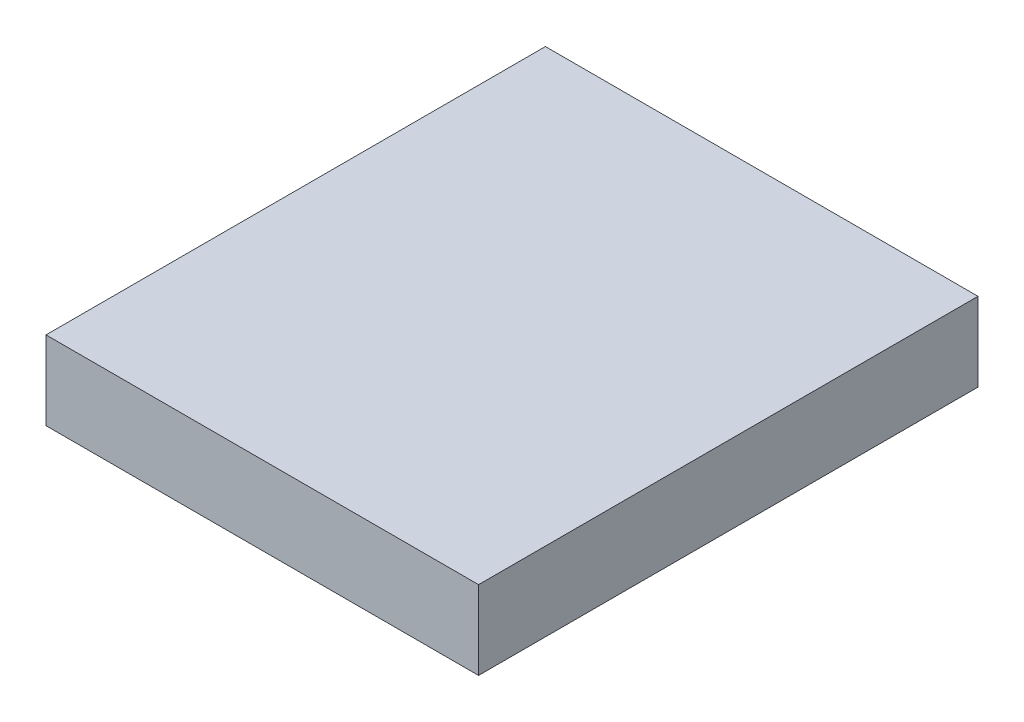
ISO-10303-21;
HEADER;
FILE_DESCRIPTION(('STEP AP214'),'2;1');
FILE_NAME('part.step','',(''),(''),'','','');
FILE_SCHEMA(('AUTOMOTIVE_DESIGN { 1 0 10303 214 1 1 1 1 }'));
ENDSEC;
DATA;
#1=APPLICATION_CONTEXT('core data for automotive mechanical design processes');
#2=APPLICATION_PROTOCOL_DEFINITION('international standard','automotive_design',2000,#1);
#3=PRODUCT_CONTEXT('',#1,'mechanical');
#4=PRODUCT('Part','Part','',(#3));
#5=PRODUCT_RELATED_PRODUCT_CATEGORY('part','',(#4));
#6=PRODUCT_DEFINITION_FORMATION('','',#4);
#7=PRODUCT_DEFINITION_CONTEXT('part definition',#1,'design');
#8=PRODUCT_DEFINITION('design','',#6,#7);
#9=PRODUCT_DEFINITION_SHAPE('','',#8);
#10=(LENGTH_UNIT() NAMED_UNIT(*) SI_UNIT(.MILLI.,.METRE.));
#11=(NAMED_UNIT(*) PLANE_ANGLE_UNIT() SI_UNIT($,.RADIAN.));
#12=(NAMED_UNIT(*) SI_UNIT($,.STERADIAN.) SOLID_ANGLE_UNIT());
#13=UNCERTAINTY_MEASURE_WITH_UNIT(LENGTH_MEASURE(1.E-05),#10,'distance_accuracy_value','');
#14=(GEOMETRIC_REPRESENTATION_CONTEXT(3) GLOBAL_UNCERTAINTY_ASSIGNED_CONTEXT((#13)) GLOBAL_UNIT_ASSIGNED_CONTEXT((#10,
#11,#12)) REPRESENTATION_CONTEXT('',''));
#15=CARTESIAN_POINT('',(0.,0.,0.));
#16=DIRECTION('',(0.,0.,1.));
#17=DIRECTION('',(1.,0.,0.));
#18=AXIS2_PLACEMENT_3D('',#15,#16,#17);
#19=CARTESIAN_POINT('',(-7.875,0.,7.5));
#20=DIRECTION('',(-1.,0.,0.));
#21=DIRECTION('',(0.,0.,1.));
#22=AXIS2_PLACEMENT_3D('',#19,#20,#21);
#23=PLANE('',#22);
#24=DIRECTION('',(0.,0.,-1.));
#25=VECTOR('',#24,1.);
#26=CARTESIAN_POINT('',(-7.875,5.28615257023821,7.5));
#27=LINE('',#26,#25);
#28=CARTESIAN_POINT('',(-7.875,5.28615257023821,-1.75));
#29=VERTEX_POINT('',#28);
#30=CARTESIAN_POINT('',(-7.875,5.28615257023821,-7.5));
#31=VERTEX_POINT('',#30);
#32=EDGE_CURVE('E290',#29,#31,#27,.T.);
#33=ORIENTED_EDGE('',*,*,#32,.F.);
#34=DIRECTION('',(0.,1.,0.));
#35=VECTOR('',#34,1.);
#36=CARTESIAN_POINT('',(-7.875,0.,-1.75));
#37=LINE('',#36,#35);
#38=CARTESIAN_POINT('',(-7.875,7.68012857965234,-1.75));
#39=VERTEX_POINT('',#38);
#40=EDGE_CURVE('E973',#29,#39,#37,.T.);
#41=ORIENTED_EDGE('',*,*,#40,.T.);
#42=DIRECTION('',(0.,0.,1.));
#43=VECTOR('',#42,1.);
#44=CARTESIAN_POINT('',(-7.875,7.68012857965234,-1.75));
#45=LINE('',#44,#43);
#46=CARTESIAN_POINT('',(-7.875,7.68012857965234,1.75));
#47=VERTEX_POINT('',#46);
#48=EDGE_CURVE('E491',#39,#47,#45,.T.);
#49=ORIENTED_EDGE('',*,*,#48,.T.);
#50=DIRECTION('',(0.,1.,0.));
#51=VECTOR('',#50,1.);
#52=CARTESIAN_POINT('',(-7.875,0.,1.75));
#53=LINE('',#52,#51);
#54=CARTESIAN_POINT('',(-7.875,5.28615257023821,1.75));
#55=VERTEX_POINT('',#54);
#56=EDGE_CURVE('E948',#55,#47,#53,.T.);
#57=ORIENTED_EDGE('',*,*,#56,.F.);
#58=CARTESIAN_POINT('',(-7.875,5.28615257023821,7.5));
#59=VERTEX_POINT('',#58);
#60=EDGE_CURVE('E291',#59,#55,#27,.T.);
#61=ORIENTED_EDGE('',*,*,#60,.F.);
#62=DIRECTION('',(0.,1.,0.));
#63=VECTOR('',#62,1.);
#64=CARTESIAN_POINT('',(-7.875,0.,7.5));
#65=LINE('',#64,#63);
#66=CARTESIAN_POINT('',(-7.875,21.5361525702382,7.5));
#67=VERTEX_POINT('',#66);
#68=EDGE_CURVE('E431',#59,#67,#65,.T.);
#69=ORIENTED_EDGE('',*,*,#68,.T.);
#70=DIRECTION('',(0.,0.,-1.));
#71=VECTOR('',#70,1.);
#72=CARTESIAN_POINT('',(-7.875,21.5361525702382,7.5));
#73=LINE('',#72,#71);
#74=CARTESIAN_POINT('',(-7.875,21.5361525702382,-7.5));
#75=VERTEX_POINT('',#74);
#76=EDGE_CURVE('E365',#67,#75,#73,.T.);
#77=ORIENTED_EDGE('',*,*,#76,.T.);
#78=DIRECTION('',(0.,1.,0.));
#79=VECTOR('',#78,1.);
#80=CARTESIAN_POINT('',(-7.875,0.,-7.5));
#81=LINE('',#80,#79);
#82=EDGE_CURVE('E487',#31,#75,#81,.T.);
#83=ORIENTED_EDGE('',*,*,#82,.F.);
#84=EDGE_LOOP('',(#33,#41,#49,#57,#61,#69,#77,#83));
#85=FACE_BOUND('',#84,.T.);
#86=ADVANCED_FACE('F45',(#85),#23,.T.);
#87=CARTESIAN_POINT('',(-6.125,5.28615257023821,7.5));
#88=DIRECTION('',(0.,0.,-1.));
#89=DIRECTION('',(-1.,0.,0.));
#90=AXIS2_PLACEMENT_3D('',#87,#88,#89);
#91=CYLINDRICAL_SURFACE('',#90,1.75);
#92=DIRECTION('',(0.,0.,-1.));
#93=VECTOR('',#92,1.);
#94=CARTESIAN_POINT('',(-6.125,3.53615257023821,7.5));
#95=LINE('',#94,#93);
#96=CARTESIAN_POINT('',(-6.125,3.53615257023821,-1.75));
#97=VERTEX_POINT('',#96);
#98=CARTESIAN_POINT('',(-6.125,3.53615257023821,-7.5));
#99=VERTEX_POINT('',#98);
#100=EDGE_CURVE('E285',#97,#99,#95,.T.);
#101=ORIENTED_EDGE('',*,*,#100,.F.);
#102=CARTESIAN_POINT('',(-6.125,5.28615257023821,-1.75));
#103=DIRECTION('',(0.,0.,1.));
#104=DIRECTION('',(1.,0.,0.));
#105=AXIS2_PLACEMENT_3D('',#102,#103,#104);
#106=CIRCLE('',#105,1.75);
#107=EDGE_CURVE('E528',#97,#29,#106,.F.);
#108=ORIENTED_EDGE('',*,*,#107,.T.);
#109=ORIENTED_EDGE('',*,*,#32,.T.);
#110=CARTESIAN_POINT('',(-6.125,5.28615257023821,-7.5));
#111=DIRECTION('',(0.,0.,1.));
#112=DIRECTION('',(1.,0.,0.));
#113=AXIS2_PLACEMENT_3D('',#110,#111,#112);
#114=CIRCLE('',#113,1.75);
#115=EDGE_CURVE('E490',#99,#31,#114,.F.);
#116=ORIENTED_EDGE('',*,*,#115,.F.);
#117=EDGE_LOOP('',(#101,#108,#109,#116));
#118=FACE_BOUND('',#117,.T.);
#119=ADVANCED_FACE('F525',(#118),#91,.T.);
#120=CARTESIAN_POINT('',(0.,3.53615257023816,7.5));
#121=DIRECTION('',(0.,-1.,0.));
#122=DIRECTION('',(1.,0.,0.));
#123=AXIS2_PLACEMENT_3D('',#120,#121,#122);
#124=PLANE('',#123);
#125=DIRECTION('',(0.,0.,-1.));
#126=VECTOR('',#125,1.);
#127=CARTESIAN_POINT('',(-6.01990065414504,3.53615257023821,7.5));
#128=LINE('',#127,#126);
#129=CARTESIAN_POINT('',(-6.01990065414504,3.53615257023821,-1.75));
#130=VERTEX_POINT('',#129);
#131=CARTESIAN_POINT('',(-6.01990065414504,3.53615257023821,-7.5));
#132=VERTEX_POINT('',#131);
#133=EDGE_CURVE('E280',#130,#132,#128,.T.);
#134=ORIENTED_EDGE('',*,*,#133,.F.);
#135=DIRECTION('',(-1.,0.,0.));
#136=VECTOR('',#135,1.);
#137=CARTESIAN_POINT('',(0.,3.53615257023816,-1.75));
#138=LINE('',#137,#136);
#139=EDGE_CURVE('E991',#130,#97,#138,.T.);
#140=ORIENTED_EDGE('',*,*,#139,.T.);
#141=ORIENTED_EDGE('',*,*,#100,.T.);
#142=DIRECTION('',(-1.,0.,0.));
#143=VECTOR('',#142,1.);
#144=CARTESIAN_POINT('',(0.,3.53615257023816,-7.5));
#145=LINE('',#144,#143);
#146=EDGE_CURVE('E495',#132,#99,#145,.T.);
#147=ORIENTED_EDGE('',*,*,#146,.F.);
#148=EDGE_LOOP('',(#134,#140,#141,#147));
#149=FACE_BOUND('',#148,.T.);
#150=ADVANCED_FACE('F520',(#149),#124,.T.);
#151=CARTESIAN_POINT('',(-6.01990065414504,9.53615257023822,7.5));
#152=DIRECTION('',(0.,0.,-1.));
#153=DIRECTION('',(-1.,0.,0.));
#154=AXIS2_PLACEMENT_3D('',#151,#152,#153);
#155=CYLINDRICAL_SURFACE('',#154,6.);
#156=DIRECTION('',(0.,0.,-1.));
#157=VECTOR('',#156,1.);
#158=CARTESIAN_POINT('',(-1.951498019203,5.12615257023859,7.5));
#159=LINE('',#158,#157);
#160=CARTESIAN_POINT('',(-1.951498019203,5.12615257023859,-1.75));
#161=VERTEX_POINT('',#160);
#162=CARTESIAN_POINT('',(-1.951498019203,5.12615257023859,-7.5));
#163=VERTEX_POINT('',#162);
#164=EDGE_CURVE('E275',#161,#163,#159,.T.);
#165=ORIENTED_EDGE('',*,*,#164,.F.);
#166=CARTESIAN_POINT('',(-6.01990065414504,9.53615257023822,-1.75));
#167=DIRECTION('',(0.,0.,1.));
#168=DIRECTION('',(1.,0.,0.));
#169=AXIS2_PLACEMENT_3D('',#166,#167,#168);
#170=CIRCLE('',#169,6.);
#171=EDGE_CURVE('E516',#161,#130,#170,.F.);
#172=ORIENTED_EDGE('',*,*,#171,.T.);
#173=ORIENTED_EDGE('',*,*,#133,.T.);
#174=CARTESIAN_POINT('',(-6.01990065414504,9.53615257023822,-7.5));
#175=DIRECTION('',(0.,0.,1.));
#176=DIRECTION('',(1.,0.,0.));
#177=AXIS2_PLACEMENT_3D('',#174,#175,#176);
#178=CIRCLE('',#177,6.);
#179=EDGE_CURVE('E499',#163,#132,#178,.F.);
#180=ORIENTED_EDGE('',*,*,#179,.F.);
#181=EDGE_LOOP('',(#165,#172,#173,#180));
#182=FACE_BOUND('',#181,.T.);
#183=ADVANCED_FACE('F512',(#182),#155,.T.);
#184=CARTESIAN_POINT('',(-3.45201844820354,3.74186203347426,7.5));
#185=DIRECTION('',(0.678067105823674,-0.734999999999936,0.));
#186=DIRECTION('',(0.734999999999936,0.678067105823674,0.));
#187=AXIS2_PLACEMENT_3D('',#184,#185,#186);
#188=PLANE('',#187);
#189=DIRECTION('',(-0.734999999999936,-0.678067105823674,0.));
#190=VECTOR('',#189,1.);
#191=CARTESIAN_POINT('',(-3.45201844820354,3.74186203347426,-1.75));
#192=LINE('',#191,#190);
#193=CARTESIAN_POINT('',(-2.37323487038286,4.73708333745119,-1.75));
#194=VERTEX_POINT('',#193);
#195=EDGE_CURVE('E238',#161,#194,#192,.T.);
#196=ORIENTED_EDGE('',*,*,#195,.F.);
#197=ORIENTED_EDGE('',*,*,#164,.T.);
#198=DIRECTION('',(-0.734999999999936,-0.678067105823674,0.));
#199=VECTOR('',#198,1.);
#200=CARTESIAN_POINT('',(-3.45201844820354,3.74186203347426,-7.5));
#201=LINE('',#200,#199);
#202=CARTESIAN_POINT('',(-2.37323487038286,4.73708333745119,-7.5));
#203=VERTEX_POINT('',#202);
#204=EDGE_CURVE('E503',#163,#203,#201,.T.);
#205=ORIENTED_EDGE('',*,*,#204,.T.);
#206=DIRECTION('',(0.,0.,-1.));
#207=VECTOR('',#206,1.);
#208=CARTESIAN_POINT('',(-2.37323487038286,4.73708333745119,7.5));
#209=LINE('',#208,#207);
#210=EDGE_CURVE('E266',#194,#203,#209,.T.);
#211=ORIENTED_EDGE('',*,*,#210,.F.);
#212=EDGE_LOOP('',(#196,#197,#205,#211));
#213=FACE_BOUND('',#212,.T.);
#214=ADVANCED_FACE('F601',(#213),#188,.F.);
#215=CARTESIAN_POINT('',(0.,2.16458333745141,7.5));
#216=DIRECTION('',(0.,0.,-1.));
#217=DIRECTION('',(-1.,0.,0.));
#218=AXIS2_PLACEMENT_3D('',#215,#216,#217);
#219=CYLINDRICAL_SURFACE('',#218,3.5);
#220=DIRECTION('',(0.,0.,-1.));
#221=VECTOR('',#220,1.);
#222=CARTESIAN_POINT('',(2.37323487038286,4.73708333745119,7.5));
#223=LINE('',#222,#221);
#224=CARTESIAN_POINT('',(2.37323487038286,4.73708333745119,-1.75));
#225=VERTEX_POINT('',#224);
#226=CARTESIAN_POINT('',(2.37323487038286,4.73708333745119,-7.5));
#227=VERTEX_POINT('',#226);
#228=EDGE_CURVE('E249',#225,#227,#223,.T.);
#229=ORIENTED_EDGE('',*,*,#228,.F.);
#230=CARTESIAN_POINT('',(0.,2.16458333745141,-1.75));
#231=DIRECTION('',(0.,0.,1.));
#232=DIRECTION('',(1.,0.,0.));
#233=AXIS2_PLACEMENT_3D('',#230,#231,#232);
#234=CIRCLE('',#233,3.5);
#235=EDGE_CURVE('E231',#225,#194,#234,.T.);
#236=ORIENTED_EDGE('',*,*,#235,.T.);
#237=ORIENTED_EDGE('',*,*,#210,.T.);
#238=CARTESIAN_POINT('',(0.,2.16458333745141,-7.5));
#239=DIRECTION('',(0.,0.,1.));
#240=DIRECTION('',(1.,0.,0.));
#241=AXIS2_PLACEMENT_3D('',#238,#239,#240);
#242=CIRCLE('',#241,3.5);
#243=EDGE_CURVE('E258',#227,#203,#242,.T.);
#244=ORIENTED_EDGE('',*,*,#243,.F.);
#245=EDGE_LOOP('',(#229,#236,#237,#244));
#246=FACE_BOUND('',#245,.T.);
#247=ADVANCED_FACE('F256',(#246),#219,.F.);
#248=CARTESIAN_POINT('',(3.45201844820354,3.74186203347427,7.5));
#249=DIRECTION('',(-0.678067105823674,-0.734999999999937,0.));
#250=DIRECTION('',(0.734999999999937,-0.678067105823674,0.));
#251=AXIS2_PLACEMENT_3D('',#248,#249,#250);
#252=PLANE('',#251);
#253=DIRECTION('',(-0.734999999999937,0.678067105823674,0.));
#254=VECTOR('',#253,1.);
#255=CARTESIAN_POINT('',(3.45201844820354,3.74186203347427,-1.75));
#256=LINE('',#255,#254);
#257=CARTESIAN_POINT('',(1.95149801920299,5.1261525702386,-1.75));
#258=VERTEX_POINT('',#257);
#259=EDGE_CURVE('E235',#225,#258,#256,.T.);
#260=ORIENTED_EDGE('',*,*,#259,.F.);
#261=ORIENTED_EDGE('',*,*,#228,.T.);
#262=DIRECTION('',(-0.734999999999937,0.678067105823674,0.));
#263=VECTOR('',#262,1.);
#264=CARTESIAN_POINT('',(3.45201844820354,3.74186203347427,-7.5));
#265=LINE('',#264,#263);
#266=CARTESIAN_POINT('',(1.95149801920299,5.1261525702386,-7.5));
#267=VERTEX_POINT('',#266);
#268=EDGE_CURVE('E412',#227,#267,#265,.T.);
#269=ORIENTED_EDGE('',*,*,#268,.T.);
#270=DIRECTION('',(0.,0.,-1.));
#271=VECTOR('',#270,1.);
#272=CARTESIAN_POINT('',(1.95149801920299,5.1261525702386,7.5));
#273=LINE('',#272,#271);
#274=EDGE_CURVE('E251',#258,#267,#273,.T.);
#275=ORIENTED_EDGE('',*,*,#274,.F.);
#276=EDGE_LOOP('',(#260,#261,#269,#275));
#277=FACE_BOUND('',#276,.T.);
#278=ADVANCED_FACE('F247',(#277),#252,.F.);
#279=CARTESIAN_POINT('',(6.01990065414504,9.53615257023822,7.5));
#280=DIRECTION('',(0.,0.,-1.));
#281=DIRECTION('',(-1.,0.,0.));
#282=AXIS2_PLACEMENT_3D('',#279,#280,#281);
#283=CYLINDRICAL_SURFACE('',#282,6.);
#284=DIRECTION('',(0.,0.,-1.));
#285=VECTOR('',#284,1.);
#286=CARTESIAN_POINT('',(6.01990065414504,3.53615257023821,7.5));
#287=LINE('',#286,#285);
#288=CARTESIAN_POINT('',(6.01990065414504,3.53615257023821,-1.75));
#289=VERTEX_POINT('',#288);
#290=CARTESIAN_POINT('',(6.01990065414504,3.53615257023821,-7.5));
#291=VERTEX_POINT('',#290);
#292=EDGE_CURVE('E381',#289,#291,#287,.T.);
#293=ORIENTED_EDGE('',*,*,#292,.F.);
#294=CARTESIAN_POINT('',(6.01990065414504,9.53615257023822,-1.75));
#295=DIRECTION('',(0.,0.,1.));
#296=DIRECTION('',(1.,0.,0.));
#297=AXIS2_PLACEMENT_3D('',#294,#295,#296);
#298=CIRCLE('',#297,6.);
#299=EDGE_CURVE('E253',#289,#258,#298,.F.);
#300=ORIENTED_EDGE('',*,*,#299,.T.);
#301=ORIENTED_EDGE('',*,*,#274,.T.);
#302=CARTESIAN_POINT('',(6.01990065414504,9.53615257023822,-7.5));
#303=DIRECTION('',(0.,0.,1.));
#304=DIRECTION('',(1.,0.,0.));
#305=AXIS2_PLACEMENT_3D('',#302,#303,#304);
#306=CIRCLE('',#305,6.);
#307=EDGE_CURVE('E405',#291,#267,#306,.F.);
#308=ORIENTED_EDGE('',*,*,#307,.F.);
#309=EDGE_LOOP('',(#293,#300,#301,#308));
#310=FACE_BOUND('',#309,.T.);
#311=ADVANCED_FACE('F410',(#310),#283,.T.);
#312=CARTESIAN_POINT('',(0.,3.53615257023824,7.5));
#313=DIRECTION('',(0.,1.,0.));
#314=DIRECTION('',(-1.,0.,0.));
#315=AXIS2_PLACEMENT_3D('',#312,#313,#314);
#316=PLANE('',#315);
#317=DIRECTION('',(1.,0.,0.));
#318=VECTOR('',#317,1.);
#319=CARTESIAN_POINT('',(0.,3.53615257023824,-1.75));
#320=LINE('',#319,#318);
#321=CARTESIAN_POINT('',(6.125,3.53615257023821,-1.75));
#322=VERTEX_POINT('',#321);
#323=EDGE_CURVE('E399',#289,#322,#320,.T.);
#324=ORIENTED_EDGE('',*,*,#323,.F.);
#325=ORIENTED_EDGE('',*,*,#292,.T.);
#326=DIRECTION('',(1.,0.,0.));
#327=VECTOR('',#326,1.);
#328=CARTESIAN_POINT('',(0.,3.53615257023824,-7.5));
#329=LINE('',#328,#327);
#330=CARTESIAN_POINT('',(6.125,3.53615257023821,-7.5));
#331=VERTEX_POINT('',#330);
#332=EDGE_CURVE('E397',#291,#331,#329,.T.);
#333=ORIENTED_EDGE('',*,*,#332,.T.);
#334=DIRECTION('',(0.,0.,-1.));
#335=VECTOR('',#334,1.);
#336=CARTESIAN_POINT('',(6.125,3.53615257023821,7.5));
#337=LINE('',#336,#335);
#338=EDGE_CURVE('E377',#322,#331,#337,.T.);
#339=ORIENTED_EDGE('',*,*,#338,.F.);
#340=EDGE_LOOP('',(#324,#325,#333,#339));
#341=FACE_BOUND('',#340,.T.);
#342=ADVANCED_FACE('F395',(#341),#316,.F.);
#343=CARTESIAN_POINT('',(6.125,5.28615257023822,7.5));
#344=DIRECTION('',(0.,0.,-1.));
#345=DIRECTION('',(-1.,0.,0.));
#346=AXIS2_PLACEMENT_3D('',#343,#344,#345);
#347=CYLINDRICAL_SURFACE('',#346,1.75);
#348=CARTESIAN_POINT('',(6.125,5.28615257023822,-1.75));
#349=DIRECTION('',(0.,0.,1.));
#350=DIRECTION('',(1.,0.,0.));
#351=AXIS2_PLACEMENT_3D('',#348,#349,#350);
#352=CIRCLE('',#351,1.75);
#353=CARTESIAN_POINT('',(7.875,5.28615257023822,-1.75));
#354=VERTEX_POINT('',#353);
#355=EDGE_CURVE('E985',#322,#354,#352,.T.);
#356=ORIENTED_EDGE('',*,*,#355,.F.);
#357=ORIENTED_EDGE('',*,*,#338,.T.);
#358=CARTESIAN_POINT('',(6.125,5.28615257023822,-7.5));
#359=DIRECTION('',(0.,0.,1.));
#360=DIRECTION('',(1.,0.,0.));
#361=AXIS2_PLACEMENT_3D('',#358,#359,#360);
#362=CIRCLE('',#361,1.75);
#363=CARTESIAN_POINT('',(7.875,5.28615257023822,-7.5));
#364=VERTEX_POINT('',#363);
#365=EDGE_CURVE('E407',#331,#364,#362,.T.);
#366=ORIENTED_EDGE('',*,*,#365,.T.);
#367=DIRECTION('',(0.,0.,-1.));
#368=VECTOR('',#367,1.);
#369=CARTESIAN_POINT('',(7.875,5.28615257023822,7.5));
#370=LINE('',#369,#368);
#371=EDGE_CURVE('E364',#354,#364,#370,.T.);
#372=ORIENTED_EDGE('',*,*,#371,.F.);
#373=EDGE_LOOP('',(#356,#357,#366,#372));
#374=FACE_BOUND('',#373,.T.);
#375=ADVANCED_FACE('F641',(#374),#347,.T.);
#376=CARTESIAN_POINT('',(7.875,0.,7.5));
#377=DIRECTION('',(-1.,0.,0.));
#378=DIRECTION('',(0.,-1.,0.));
#379=AXIS2_PLACEMENT_3D('',#376,#377,#378);
#380=PLANE('',#379);
#381=DIRECTION('',(0.,1.,0.));
#382=VECTOR('',#381,1.);
#383=CARTESIAN_POINT('',(7.875,0.,-1.75));
#384=LINE('',#383,#382);
#385=CARTESIAN_POINT('',(7.875,7.68012857965267,-1.75));
#386=VERTEX_POINT('',#385);
#387=EDGE_CURVE('E978',#354,#386,#384,.T.);
#388=ORIENTED_EDGE('',*,*,#387,.F.);
#389=ORIENTED_EDGE('',*,*,#371,.T.);
#390=DIRECTION('',(0.,1.,0.));
#391=VECTOR('',#390,1.);
#392=CARTESIAN_POINT('',(7.875,0.,-7.5));
#393=LINE('',#392,#391);
#394=CARTESIAN_POINT('',(7.875,21.5361525702382,-7.5));
#395=VERTEX_POINT('',#394);
#396=EDGE_CURVE('E420',#364,#395,#393,.T.);
#397=ORIENTED_EDGE('',*,*,#396,.T.);
#398=DIRECTION('',(0.,0.,-1.));
#399=VECTOR('',#398,1.);
#400=CARTESIAN_POINT('',(7.875,21.5361525702382,7.5));
#401=LINE('',#400,#399);
#402=CARTESIAN_POINT('',(7.875,21.5361525702382,7.5));
#403=VERTEX_POINT('',#402);
#404=EDGE_CURVE('E358',#403,#395,#401,.T.);
#405=ORIENTED_EDGE('',*,*,#404,.F.);
#406=DIRECTION('',(0.,1.,0.));
#407=VECTOR('',#406,1.);
#408=CARTESIAN_POINT('',(7.875,0.,7.5));
#409=LINE('',#408,#407);
#410=CARTESIAN_POINT('',(7.875,5.28615257023822,7.5));
#411=VERTEX_POINT('',#410);
#412=EDGE_CURVE('E475',#411,#403,#409,.T.);
#413=ORIENTED_EDGE('',*,*,#412,.F.);
#414=CARTESIAN_POINT('',(7.875,5.28615257023822,1.75));
#415=VERTEX_POINT('',#414);
#416=EDGE_CURVE('E369',#411,#415,#370,.T.);
#417=ORIENTED_EDGE('',*,*,#416,.T.);
#418=DIRECTION('',(0.,1.,0.));
#419=VECTOR('',#418,1.);
#420=CARTESIAN_POINT('',(7.875,0.,1.75));
#421=LINE('',#420,#419);
#422=CARTESIAN_POINT('',(7.875,7.68012857965267,1.75));
#423=VERTEX_POINT('',#422);
#424=EDGE_CURVE('E942',#415,#423,#421,.T.);
#425=ORIENTED_EDGE('',*,*,#424,.T.);
#426=DIRECTION('',(0.,0.,1.));
#427=VECTOR('',#426,1.);
#428=CARTESIAN_POINT('',(7.875,7.68012857965267,-1.75));
#429=LINE('',#428,#427);
#430=EDGE_CURVE('E445',#386,#423,#429,.T.);
#431=ORIENTED_EDGE('',*,*,#430,.F.);
#432=EDGE_LOOP('',(#388,#389,#397,#405,#413,#417,#425,#431));
#433=FACE_BOUND('',#432,.T.);
#434=ADVANCED_FACE('F781',(#433),#380,.F.);
#435=CARTESIAN_POINT('',(-5.65685424949238,5.65685424949238,7.5));
#436=DIRECTION('',(0.,0.,-1.));
#437=DIRECTION('',(-1.,0.,0.));
#438=AXIS2_PLACEMENT_3D('',#435,#436,#437);
#439=CYLINDRICAL_SURFACE('',#438,1.75000000000003);
#440=CARTESIAN_POINT('',(-5.65685424949238,5.65685424949238,-7.5));
#441=DIRECTION('',(0.,0.,1.));
#442=DIRECTION('',(1.,0.,0.));
#443=AXIS2_PLACEMENT_3D('',#440,#441,#442);
#444=CIRCLE('',#443,1.75000000000003);
#445=CARTESIAN_POINT('',(-3.90685424949235,5.65685424949238,-7.5));
#446=VERTEX_POINT('',#445);
#447=EDGE_CURVE('E425',#446,#446,#444,.T.);
#448=ORIENTED_EDGE('',*,*,#447,.F.);
#449=EDGE_LOOP('',(#448));
#450=FACE_BOUND('',#449,.T.);
#451=CARTESIAN_POINT('',(-5.65685424949238,5.65685424949238,-1.75));
#452=DIRECTION('',(0.,0.,1.));
#453=DIRECTION('',(1.,0.,0.));
#454=AXIS2_PLACEMENT_3D('',#451,#452,#453);
#455=CIRCLE('',#454,1.75000000000003);
#456=CARTESIAN_POINT('',(-3.90685424949235,5.65685424949238,-1.75));
#457=VERTEX_POINT('',#456);
#458=EDGE_CURVE('E917',#457,#457,#455,.T.);
#459=ORIENTED_EDGE('',*,*,#458,.T.);
#460=EDGE_LOOP('',(#459));
#461=FACE_BOUND('',#460,.T.);
#462=ADVANCED_FACE('F650',(#450,#461),#439,.F.);
#463=CARTESIAN_POINT('',(5.65685424949237,5.65685424949239,7.5));
#464=DIRECTION('',(0.,0.,-1.));
#465=DIRECTION('',(-1.,0.,0.));
#466=AXIS2_PLACEMENT_3D('',#463,#464,#465);
#467=CYLINDRICAL_SURFACE('',#466,1.75);
#468=CARTESIAN_POINT('',(5.65685424949237,5.65685424949239,-7.5));
#469=DIRECTION('',(0.,0.,1.));
#470=DIRECTION('',(1.,0.,0.));
#471=AXIS2_PLACEMENT_3D('',#468,#469,#470);
#472=CIRCLE('',#471,1.75);
#473=CARTESIAN_POINT('',(7.40685424949237,5.65685424949239,-7.5));
#474=VERTEX_POINT('',#473);
#475=EDGE_CURVE('E428',#474,#474,#472,.T.);
#476=ORIENTED_EDGE('',*,*,#475,.F.);
#477=EDGE_LOOP('',(#476));
#478=FACE_BOUND('',#477,.T.);
#479=CARTESIAN_POINT('',(5.65685424949237,5.65685424949239,-1.75));
#480=DIRECTION('',(0.,0.,1.));
#481=DIRECTION('',(1.,0.,0.));
#482=AXIS2_PLACEMENT_3D('',#479,#480,#481);
#483=CIRCLE('',#482,1.75);
#484=CARTESIAN_POINT('',(7.40685424949237,5.65685424949239,-1.75));
#485=VERTEX_POINT('',#484);
#486=EDGE_CURVE('E914',#485,#485,#483,.T.);
#487=ORIENTED_EDGE('',*,*,#486,.T.);
#488=EDGE_LOOP('',(#487));
#489=FACE_BOUND('',#488,.T.);
#490=ADVANCED_FACE('F354',(#478,#489),#467,.F.);
#491=CARTESIAN_POINT('',(0.,21.5361525702382,38.1));
#492=DIRECTION('',(0.,-1.,0.));
#493=DIRECTION('',(0.,0.,-1.));
#494=AXIS2_PLACEMENT_3D('',#491,#492,#493);
#495=PLANE('',#494);
#496=DIRECTION('',(-1.,0.,0.));
#497=VECTOR('',#496,1.);
#498=CARTESIAN_POINT('',(0.,21.5361525702382,-38.1));
#499=LINE('',#498,#497);
#500=CARTESIAN_POINT('',(33.,21.5361525702382,-38.1));
#501=VERTEX_POINT('',#500);
#502=CARTESIAN_POINT('',(-33.,21.5361525702382,-38.1));
#503=VERTEX_POINT('',#502);
#504=EDGE_CURVE('E295',#501,#503,#499,.T.);
#505=ORIENTED_EDGE('',*,*,#504,.F.);
#506=DIRECTION('',(0.,0.,-1.));
#507=VECTOR('',#506,1.);
#508=CARTESIAN_POINT('',(33.,21.5361525702382,38.1));
#509=LINE('',#508,#507);
#510=CARTESIAN_POINT('',(33.,21.5361525702382,38.1));
#511=VERTEX_POINT('',#510);
#512=EDGE_CURVE('E11',#511,#501,#509,.T.);
#513=ORIENTED_EDGE('',*,*,#512,.F.);
#514=DIRECTION('',(-1.,0.,0.));
#515=VECTOR('',#514,1.);
#516=CARTESIAN_POINT('',(0.,21.5361525702382,38.1));
#517=LINE('',#516,#515);
#518=CARTESIAN_POINT('',(-33.,21.5361525702382,38.1));
#519=VERTEX_POINT('',#518);
#520=EDGE_CURVE('E296',#511,#519,#517,.T.);
#521=ORIENTED_EDGE('',*,*,#520,.T.);
#522=DIRECTION('',(0.,0.,-1.));
#523=VECTOR('',#522,1.);
#524=CARTESIAN_POINT('',(-33.,21.5361525702382,38.1));
#525=LINE('',#524,#523);
#526=EDGE_CURVE('E313',#519,#503,#525,.T.);
#527=ORIENTED_EDGE('',*,*,#526,.T.);
#528=EDGE_LOOP('',(#505,#513,#521,#527));
#529=FACE_BOUND('',#528,.T.);
#530=ORIENTED_EDGE('',*,*,#404,.T.);
#531=DIRECTION('',(-1.,0.,0.));
#532=VECTOR('',#531,1.);
#533=CARTESIAN_POINT('',(0.,21.5361525702382,-7.5));
#534=LINE('',#533,#532);
#535=EDGE_CURVE('E69',#395,#75,#534,.T.);
#536=ORIENTED_EDGE('',*,*,#535,.T.);
#537=ORIENTED_EDGE('',*,*,#76,.F.);
#538=DIRECTION('',(-1.,0.,0.));
#539=VECTOR('',#538,1.);
#540=CARTESIAN_POINT('',(0.,21.5361525702382,7.5));
#541=LINE('',#540,#539);
#542=EDGE_CURVE('E360',#403,#67,#541,.T.);
#543=ORIENTED_EDGE('',*,*,#542,.F.);
#544=EDGE_LOOP('',(#530,#536,#537,#543));
#545=FACE_BOUND('',#544,.T.);
#546=ADVANCED_FACE('F47',(#529,#545),#495,.T.);
#547=CARTESIAN_POINT('',(33.,0.,38.1));
#548=DIRECTION('',(1.,0.,0.));
#549=DIRECTION('',(0.,0.,-1.));
#550=AXIS2_PLACEMENT_3D('',#547,#548,#549);
#551=PLANE('',#550);
#552=DIRECTION('',(0.,-1.,0.));
#553=VECTOR('',#552,1.);
#554=CARTESIAN_POINT('',(33.,0.,-38.1));
#555=LINE('',#554,#553);
#556=CARTESIAN_POINT('',(33.,33.5361525702382,-38.1));
#557=VERTEX_POINT('',#556);
#558=EDGE_CURVE('E317',#557,#501,#555,.T.);
#559=ORIENTED_EDGE('',*,*,#558,.F.);
#560=DIRECTION('',(0.,0.,-1.));
#561=VECTOR('',#560,1.);
#562=CARTESIAN_POINT('',(33.,33.5361525702382,38.1));
#563=LINE('',#562,#561);
#564=CARTESIAN_POINT('',(33.,33.5361525702382,38.1));
#565=VERTEX_POINT('',#564);
#566=EDGE_CURVE('E54',#565,#557,#563,.T.);
#567=ORIENTED_EDGE('',*,*,#566,.F.);
#568=DIRECTION('',(0.,-1.,0.));
#569=VECTOR('',#568,1.);
#570=CARTESIAN_POINT('',(33.,0.,38.1));
#571=LINE('',#570,#569);
#572=EDGE_CURVE('E300',#565,#511,#571,.T.);
#573=ORIENTED_EDGE('',*,*,#572,.T.);
#574=ORIENTED_EDGE('',*,*,#512,.T.);
#575=EDGE_LOOP('',(#559,#567,#573,#574));
#576=FACE_BOUND('',#575,.T.);
#577=ADVANCED_FACE('F340',(#576),#551,.T.);
#578=CARTESIAN_POINT('',(0.,33.5361525702382,38.1));
#579=DIRECTION('',(0.,1.,0.));
#580=DIRECTION('',(0.,0.,1.));
#581=AXIS2_PLACEMENT_3D('',#578,#579,#580);
#582=PLANE('',#581);
#583=DIRECTION('',(1.,0.,0.));
#584=VECTOR('',#583,1.);
#585=CARTESIAN_POINT('',(0.,33.5361525702382,-38.1));
#586=LINE('',#585,#584);
#587=CARTESIAN_POINT('',(-33.,33.5361525702382,-38.1));
#588=VERTEX_POINT('',#587);
#589=EDGE_CURVE('E321',#588,#557,#586,.T.);
#590=ORIENTED_EDGE('',*,*,#589,.F.);
#591=DIRECTION('',(0.,0.,-1.));
#592=VECTOR('',#591,1.);
#593=CARTESIAN_POINT('',(-33.,33.5361525702382,38.1));
#594=LINE('',#593,#592);
#595=CARTESIAN_POINT('',(-33.,33.5361525702382,38.1));
#596=VERTEX_POINT('',#595);
#597=EDGE_CURVE('E330',#596,#588,#594,.T.);
#598=ORIENTED_EDGE('',*,*,#597,.F.);
#599=DIRECTION('',(1.,0.,0.));
#600=VECTOR('',#599,1.);
#601=CARTESIAN_POINT('',(0.,33.5361525702382,38.1));
#602=LINE('',#601,#600);
#603=EDGE_CURVE('E305',#596,#565,#602,.T.);
#604=ORIENTED_EDGE('',*,*,#603,.T.);
#605=ORIENTED_EDGE('',*,*,#566,.T.);
#606=EDGE_LOOP('',(#590,#598,#604,#605));
#607=FACE_BOUND('',#606,.T.);
#608=ADVANCED_FACE('F336',(#607),#582,.T.);
#609=CARTESIAN_POINT('',(-33.,0.,38.1));
#610=DIRECTION('',(-1.,0.,0.));
#611=DIRECTION('',(0.,0.,1.));
#612=AXIS2_PLACEMENT_3D('',#609,#610,#611);
#613=PLANE('',#612);
#614=DIRECTION('',(0.,1.,0.));
#615=VECTOR('',#614,1.);
#616=CARTESIAN_POINT('',(-33.,0.,-38.1));
#617=LINE('',#616,#615);
#618=EDGE_CURVE('E301',#503,#588,#617,.T.);
#619=ORIENTED_EDGE('',*,*,#618,.F.);
#620=ORIENTED_EDGE('',*,*,#526,.F.);
#621=DIRECTION('',(0.,1.,0.));
#622=VECTOR('',#621,1.);
#623=CARTESIAN_POINT('',(-33.,0.,38.1));
#624=LINE('',#623,#622);
#625=EDGE_CURVE('E309',#519,#596,#624,.T.);
#626=ORIENTED_EDGE('',*,*,#625,.T.);
#627=ORIENTED_EDGE('',*,*,#597,.T.);
#628=EDGE_LOOP('',(#619,#620,#626,#627));
#629=FACE_BOUND('',#628,.T.);
#630=ADVANCED_FACE('F346',(#629),#613,.T.);
#631=CARTESIAN_POINT('',(0.,0.,38.1));
#632=DIRECTION('',(0.,0.,1.));
#633=DIRECTION('',(1.,0.,0.));
#634=AXIS2_PLACEMENT_3D('',#631,#632,#633);
#635=PLANE('',#634);
#636=ORIENTED_EDGE('',*,*,#520,.F.);
#637=ORIENTED_EDGE('',*,*,#572,.F.);
#638=ORIENTED_EDGE('',*,*,#603,.F.);
#639=ORIENTED_EDGE('',*,*,#625,.F.);
#640=EDGE_LOOP('',(#636,#637,#638,#639));
#641=FACE_BOUND('',#640,.T.);
#642=ADVANCED_FACE('F350',(#641),#635,.T.);
#643=CARTESIAN_POINT('',(0.,0.,-38.1));
#644=DIRECTION('',(0.,0.,1.));
#645=DIRECTION('',(1.,0.,0.));
#646=AXIS2_PLACEMENT_3D('',#643,#644,#645);
#647=PLANE('',#646);
#648=ORIENTED_EDGE('',*,*,#504,.T.);
#649=ORIENTED_EDGE('',*,*,#618,.T.);
#650=ORIENTED_EDGE('',*,*,#589,.T.);
#651=ORIENTED_EDGE('',*,*,#558,.T.);
#652=EDGE_LOOP('',(#648,#649,#650,#651));
#653=FACE_BOUND('',#652,.T.);
#654=ADVANCED_FACE('F343',(#653),#647,.F.);
#655=CARTESIAN_POINT('',(-6.125,5.28615257023821,1.75));
#656=DIRECTION('',(0.,0.,1.));
#657=DIRECTION('',(1.,0.,0.));
#658=AXIS2_PLACEMENT_3D('',#655,#656,#657);
#659=CIRCLE('',#658,1.75);
#660=CARTESIAN_POINT('',(-6.125,3.53615257023821,1.75));
#661=VERTEX_POINT('',#660);
#662=EDGE_CURVE('E951',#661,#55,#659,.F.);
#663=ORIENTED_EDGE('',*,*,#662,.F.);
#664=CARTESIAN_POINT('',(-6.125,3.53615257023821,7.5));
#665=VERTEX_POINT('',#664);
#666=EDGE_CURVE('E286',#665,#661,#95,.T.);
#667=ORIENTED_EDGE('',*,*,#666,.F.);
#668=CARTESIAN_POINT('',(-6.125,5.28615257023821,7.5));
#669=DIRECTION('',(0.,0.,1.));
#670=DIRECTION('',(1.,0.,0.));
#671=AXIS2_PLACEMENT_3D('',#668,#669,#670);
#672=CIRCLE('',#671,1.75);
#673=EDGE_CURVE('E436',#665,#59,#672,.F.);
#674=ORIENTED_EDGE('',*,*,#673,.T.);
#675=ORIENTED_EDGE('',*,*,#60,.T.);
#676=EDGE_LOOP('',(#663,#667,#674,#675));
#677=FACE_BOUND('',#676,.T.);
#678=ADVANCED_FACE('F537',(#677),#91,.T.);
#679=DIRECTION('',(-1.,0.,0.));
#680=VECTOR('',#679,1.);
#681=CARTESIAN_POINT('',(0.,3.53615257023816,1.75));
#682=LINE('',#681,#680);
#683=CARTESIAN_POINT('',(-6.01990065414504,3.53615257023821,1.75));
#684=VERTEX_POINT('',#683);
#685=EDGE_CURVE('E954',#684,#661,#682,.T.);
#686=ORIENTED_EDGE('',*,*,#685,.F.);
#687=CARTESIAN_POINT('',(-6.01990065414504,3.53615257023821,7.5));
#688=VERTEX_POINT('',#687);
#689=EDGE_CURVE('E281',#688,#684,#128,.T.);
#690=ORIENTED_EDGE('',*,*,#689,.F.);
#691=DIRECTION('',(-1.,0.,0.));
#692=VECTOR('',#691,1.);
#693=CARTESIAN_POINT('',(0.,3.53615257023816,7.5));
#694=LINE('',#693,#692);
#695=EDGE_CURVE('E442',#688,#665,#694,.T.);
#696=ORIENTED_EDGE('',*,*,#695,.T.);
#697=ORIENTED_EDGE('',*,*,#666,.T.);
#698=EDGE_LOOP('',(#686,#690,#696,#697));
#699=FACE_BOUND('',#698,.T.);
#700=ADVANCED_FACE('F575',(#699),#124,.T.);
#701=CARTESIAN_POINT('',(-6.01990065414504,9.53615257023822,1.75));
#702=DIRECTION('',(0.,0.,1.));
#703=DIRECTION('',(1.,0.,0.));
#704=AXIS2_PLACEMENT_3D('',#701,#702,#703);
#705=CIRCLE('',#704,6.);
#706=CARTESIAN_POINT('',(-1.951498019203,5.12615257023859,1.75));
#707=VERTEX_POINT('',#706);
#708=EDGE_CURVE('E957',#707,#684,#705,.F.);
#709=ORIENTED_EDGE('',*,*,#708,.F.);
#710=CARTESIAN_POINT('',(-1.951498019203,5.12615257023859,7.5));
#711=VERTEX_POINT('',#710);
#712=EDGE_CURVE('E276',#711,#707,#159,.T.);
#713=ORIENTED_EDGE('',*,*,#712,.F.);
#714=CARTESIAN_POINT('',(-6.01990065414504,9.53615257023822,7.5));
#715=DIRECTION('',(0.,0.,1.));
#716=DIRECTION('',(1.,0.,0.));
#717=AXIS2_PLACEMENT_3D('',#714,#715,#716);
#718=CIRCLE('',#717,6.);
#719=EDGE_CURVE('E451',#711,#688,#718,.F.);
#720=ORIENTED_EDGE('',*,*,#719,.T.);
#721=ORIENTED_EDGE('',*,*,#689,.T.);
#722=EDGE_LOOP('',(#709,#713,#720,#721));
#723=FACE_BOUND('',#722,.T.);
#724=ADVANCED_FACE('F583',(#723),#155,.T.);
#725=ORIENTED_EDGE('',*,*,#712,.T.);
#726=DIRECTION('',(-0.734999999999936,-0.678067105823674,0.));
#727=VECTOR('',#726,1.);
#728=CARTESIAN_POINT('',(-3.45201844820354,3.74186203347426,1.75));
#729=LINE('',#728,#727);
#730=CARTESIAN_POINT('',(-2.37323487038286,4.73708333745119,1.75));
#731=VERTEX_POINT('',#730);
#732=EDGE_CURVE('E960',#707,#731,#729,.T.);
#733=ORIENTED_EDGE('',*,*,#732,.T.);
#734=CARTESIAN_POINT('',(-2.37323487038286,4.73708333745119,7.5));
#735=VERTEX_POINT('',#734);
#736=EDGE_CURVE('E271',#735,#731,#209,.T.);
#737=ORIENTED_EDGE('',*,*,#736,.F.);
#738=DIRECTION('',(-0.734999999999936,-0.678067105823674,0.));
#739=VECTOR('',#738,1.);
#740=CARTESIAN_POINT('',(-3.45201844820354,3.74186203347426,7.5));
#741=LINE('',#740,#739);
#742=EDGE_CURVE('E455',#711,#735,#741,.T.);
#743=ORIENTED_EDGE('',*,*,#742,.F.);
#744=EDGE_LOOP('',(#725,#733,#737,#743));
#745=FACE_BOUND('',#744,.T.);
#746=ADVANCED_FACE('F590',(#745),#188,.F.);
#747=CARTESIAN_POINT('',(0.,2.16458333745141,1.75));
#748=DIRECTION('',(0.,0.,1.));
#749=DIRECTION('',(1.,0.,0.));
#750=AXIS2_PLACEMENT_3D('',#747,#748,#749);
#751=CIRCLE('',#750,3.5);
#752=CARTESIAN_POINT('',(2.37323487038286,4.73708333745119,1.75));
#753=VERTEX_POINT('',#752);
#754=EDGE_CURVE('E925',#753,#731,#751,.T.);
#755=ORIENTED_EDGE('',*,*,#754,.F.);
#756=CARTESIAN_POINT('',(2.37323487038286,4.73708333745119,7.5));
#757=VERTEX_POINT('',#756);
#758=EDGE_CURVE('E260',#757,#753,#223,.T.);
#759=ORIENTED_EDGE('',*,*,#758,.F.);
#760=CARTESIAN_POINT('',(0.,2.16458333745141,7.5));
#761=DIRECTION('',(0.,0.,1.));
#762=DIRECTION('',(1.,0.,0.));
#763=AXIS2_PLACEMENT_3D('',#760,#761,#762);
#764=CIRCLE('',#763,3.5);
#765=EDGE_CURVE('E458',#757,#735,#764,.T.);
#766=ORIENTED_EDGE('',*,*,#765,.T.);
#767=ORIENTED_EDGE('',*,*,#736,.T.);
#768=EDGE_LOOP('',(#755,#759,#766,#767));
#769=FACE_BOUND('',#768,.T.);
#770=ADVANCED_FACE('F598',(#769),#219,.F.);
#771=ORIENTED_EDGE('',*,*,#758,.T.);
#772=DIRECTION('',(-0.734999999999937,0.678067105823674,0.));
#773=VECTOR('',#772,1.);
#774=CARTESIAN_POINT('',(3.45201844820354,3.74186203347427,1.75));
#775=LINE('',#774,#773);
#776=CARTESIAN_POINT('',(1.95149801920299,5.1261525702386,1.75));
#777=VERTEX_POINT('',#776);
#778=EDGE_CURVE('E928',#753,#777,#775,.T.);
#779=ORIENTED_EDGE('',*,*,#778,.T.);
#780=CARTESIAN_POINT('',(1.95149801920299,5.1261525702386,7.5));
#781=VERTEX_POINT('',#780);
#782=EDGE_CURVE('E261',#781,#777,#273,.T.);
#783=ORIENTED_EDGE('',*,*,#782,.F.);
#784=DIRECTION('',(-0.734999999999937,0.678067105823674,0.));
#785=VECTOR('',#784,1.);
#786=CARTESIAN_POINT('',(3.45201844820354,3.74186203347427,7.5));
#787=LINE('',#786,#785);
#788=EDGE_CURVE('E462',#757,#781,#787,.T.);
#789=ORIENTED_EDGE('',*,*,#788,.F.);
#790=EDGE_LOOP('',(#771,#779,#783,#789));
#791=FACE_BOUND('',#790,.T.);
#792=ADVANCED_FACE('F607',(#791),#252,.F.);
#793=CARTESIAN_POINT('',(6.01990065414504,9.53615257023822,1.75));
#794=DIRECTION('',(0.,0.,1.));
#795=DIRECTION('',(1.,0.,0.));
#796=AXIS2_PLACEMENT_3D('',#793,#794,#795);
#797=CIRCLE('',#796,6.);
#798=CARTESIAN_POINT('',(6.01990065414504,3.53615257023821,1.75));
#799=VERTEX_POINT('',#798);
#800=EDGE_CURVE('E932',#799,#777,#797,.F.);
#801=ORIENTED_EDGE('',*,*,#800,.F.);
#802=CARTESIAN_POINT('',(6.01990065414504,3.53615257023821,7.5));
#803=VERTEX_POINT('',#802);
#804=EDGE_CURVE('E382',#803,#799,#287,.T.);
#805=ORIENTED_EDGE('',*,*,#804,.F.);
#806=CARTESIAN_POINT('',(6.01990065414504,9.53615257023822,7.5));
#807=DIRECTION('',(0.,0.,1.));
#808=DIRECTION('',(1.,0.,0.));
#809=AXIS2_PLACEMENT_3D('',#806,#807,#808);
#810=CIRCLE('',#809,6.);
#811=EDGE_CURVE('E465',#803,#781,#810,.F.);
#812=ORIENTED_EDGE('',*,*,#811,.T.);
#813=ORIENTED_EDGE('',*,*,#782,.T.);
#814=EDGE_LOOP('',(#801,#805,#812,#813));
#815=FACE_BOUND('',#814,.T.);
#816=ADVANCED_FACE('F615',(#815),#283,.T.);
#817=ORIENTED_EDGE('',*,*,#804,.T.);
#818=DIRECTION('',(1.,0.,0.));
#819=VECTOR('',#818,1.);
#820=CARTESIAN_POINT('',(0.,3.53615257023824,1.75));
#821=LINE('',#820,#819);
#822=CARTESIAN_POINT('',(6.125,3.53615257023821,1.75));
#823=VERTEX_POINT('',#822);
#824=EDGE_CURVE('E935',#799,#823,#821,.T.);
#825=ORIENTED_EDGE('',*,*,#824,.T.);
#826=CARTESIAN_POINT('',(6.125,3.53615257023821,7.5));
#827=VERTEX_POINT('',#826);
#828=EDGE_CURVE('E378',#827,#823,#337,.T.);
#829=ORIENTED_EDGE('',*,*,#828,.F.);
#830=DIRECTION('',(1.,0.,0.));
#831=VECTOR('',#830,1.);
#832=CARTESIAN_POINT('',(0.,3.53615257023824,7.5));
#833=LINE('',#832,#831);
#834=EDGE_CURVE('E469',#803,#827,#833,.T.);
#835=ORIENTED_EDGE('',*,*,#834,.F.);
#836=EDGE_LOOP('',(#817,#825,#829,#835));
#837=FACE_BOUND('',#836,.T.);
#838=ADVANCED_FACE('F623',(#837),#316,.F.);
#839=ORIENTED_EDGE('',*,*,#828,.T.);
#840=CARTESIAN_POINT('',(6.125,5.28615257023822,1.75));
#841=DIRECTION('',(0.,0.,1.));
#842=DIRECTION('',(1.,0.,0.));
#843=AXIS2_PLACEMENT_3D('',#840,#841,#842);
#844=CIRCLE('',#843,1.75);
#845=EDGE_CURVE('E938',#823,#415,#844,.T.);
#846=ORIENTED_EDGE('',*,*,#845,.T.);
#847=ORIENTED_EDGE('',*,*,#416,.F.);
#848=CARTESIAN_POINT('',(6.125,5.28615257023822,7.5));
#849=DIRECTION('',(0.,0.,1.));
#850=DIRECTION('',(1.,0.,0.));
#851=AXIS2_PLACEMENT_3D('',#848,#849,#850);
#852=CIRCLE('',#851,1.75);
#853=EDGE_CURVE('E472',#827,#411,#852,.T.);
#854=ORIENTED_EDGE('',*,*,#853,.F.);
#855=EDGE_LOOP('',(#839,#846,#847,#854));
#856=FACE_BOUND('',#855,.T.);
#857=ADVANCED_FACE('F631',(#856),#347,.T.);
#858=CARTESIAN_POINT('',(-5.65685424949238,5.65685424949238,1.75));
#859=DIRECTION('',(0.,0.,1.));
#860=DIRECTION('',(1.,0.,0.));
#861=AXIS2_PLACEMENT_3D('',#858,#859,#860);
#862=CIRCLE('',#861,1.75000000000003);
#863=CARTESIAN_POINT('',(-3.90685424949235,5.65685424949238,1.75));
#864=VERTEX_POINT('',#863);
#865=EDGE_CURVE('E964',#864,#864,#862,.T.);
#866=ORIENTED_EDGE('',*,*,#865,.F.);
#867=EDGE_LOOP('',(#866));
#868=FACE_BOUND('',#867,.T.);
#869=CARTESIAN_POINT('',(-5.65685424949238,5.65685424949238,7.5));
#870=DIRECTION('',(0.,0.,1.));
#871=DIRECTION('',(1.,0.,0.));
#872=AXIS2_PLACEMENT_3D('',#869,#870,#871);
#873=CIRCLE('',#872,1.75000000000003);
#874=CARTESIAN_POINT('',(-3.90685424949235,5.65685424949238,7.5));
#875=VERTEX_POINT('',#874);
#876=EDGE_CURVE('E480',#875,#875,#873,.T.);
#877=ORIENTED_EDGE('',*,*,#876,.T.);
#878=EDGE_LOOP('',(#877));
#879=FACE_BOUND('',#878,.T.);
#880=ADVANCED_FACE('F638',(#868,#879),#439,.F.);
#881=CARTESIAN_POINT('',(5.65685424949237,5.65685424949239,1.75));
#882=DIRECTION('',(0.,0.,1.));
#883=DIRECTION('',(1.,0.,0.));
#884=AXIS2_PLACEMENT_3D('',#881,#882,#883);
#885=CIRCLE('',#884,1.75);
#886=CARTESIAN_POINT('',(7.40685424949237,5.65685424949239,1.75));
#887=VERTEX_POINT('',#886);
#888=EDGE_CURVE('E243',#887,#887,#885,.T.);
#889=ORIENTED_EDGE('',*,*,#888,.F.);
#890=EDGE_LOOP('',(#889));
#891=FACE_BOUND('',#890,.T.);
#892=CARTESIAN_POINT('',(5.65685424949237,5.65685424949239,7.5));
#893=DIRECTION('',(0.,0.,1.));
#894=DIRECTION('',(1.,0.,0.));
#895=AXIS2_PLACEMENT_3D('',#892,#893,#894);
#896=CIRCLE('',#895,1.75);
#897=CARTESIAN_POINT('',(7.40685424949237,5.65685424949239,7.5));
#898=VERTEX_POINT('',#897);
#899=EDGE_CURVE('E371',#898,#898,#896,.T.);
#900=ORIENTED_EDGE('',*,*,#899,.T.);
#901=EDGE_LOOP('',(#900));
#902=FACE_BOUND('',#901,.T.);
#903=ADVANCED_FACE('F647',(#891,#902),#467,.F.);
#904=CARTESIAN_POINT('',(0.,0.,7.5));
#905=DIRECTION('',(0.,0.,1.));
#906=DIRECTION('',(1.,0.,0.));
#907=AXIS2_PLACEMENT_3D('',#904,#905,#906);
#908=PLANE('',#907);
#909=ORIENTED_EDGE('',*,*,#68,.F.);
#910=ORIENTED_EDGE('',*,*,#673,.F.);
#911=ORIENTED_EDGE('',*,*,#695,.F.);
#912=ORIENTED_EDGE('',*,*,#719,.F.);
#913=ORIENTED_EDGE('',*,*,#742,.T.);
#914=ORIENTED_EDGE('',*,*,#765,.F.);
#915=ORIENTED_EDGE('',*,*,#788,.T.);
#916=ORIENTED_EDGE('',*,*,#811,.F.);
#917=ORIENTED_EDGE('',*,*,#834,.T.);
#918=ORIENTED_EDGE('',*,*,#853,.T.);
#919=ORIENTED_EDGE('',*,*,#412,.T.);
#920=ORIENTED_EDGE('',*,*,#542,.T.);
#921=EDGE_LOOP('',(#909,#910,#911,#912,#913,#914,#915,#916,#917,#918,#919,#920));
#922=FACE_BOUND('',#921,.T.);
#923=ORIENTED_EDGE('',*,*,#876,.F.);
#924=EDGE_LOOP('',(#923));
#925=FACE_BOUND('',#924,.T.);
#926=ORIENTED_EDGE('',*,*,#899,.F.);
#927=EDGE_LOOP('',(#926));
#928=FACE_BOUND('',#927,.T.);
#929=ADVANCED_FACE('F656',(#922,#925,#928),#908,.T.);
#930=CARTESIAN_POINT('',(0.,0.,-7.5));
#931=DIRECTION('',(0.,0.,1.));
#932=DIRECTION('',(1.,0.,0.));
#933=AXIS2_PLACEMENT_3D('',#930,#931,#932);
#934=PLANE('',#933);
#935=ORIENTED_EDGE('',*,*,#82,.T.);
#936=ORIENTED_EDGE('',*,*,#535,.F.);
#937=ORIENTED_EDGE('',*,*,#396,.F.);
#938=ORIENTED_EDGE('',*,*,#365,.F.);
#939=ORIENTED_EDGE('',*,*,#332,.F.);
#940=ORIENTED_EDGE('',*,*,#307,.T.);
#941=ORIENTED_EDGE('',*,*,#268,.F.);
#942=ORIENTED_EDGE('',*,*,#243,.T.);
#943=ORIENTED_EDGE('',*,*,#204,.F.);
#944=ORIENTED_EDGE('',*,*,#179,.T.);
#945=ORIENTED_EDGE('',*,*,#146,.T.);
#946=ORIENTED_EDGE('',*,*,#115,.T.);
#947=EDGE_LOOP('',(#935,#936,#937,#938,#939,#940,#941,#942,#943,#944,#945,#946));
#948=FACE_BOUND('',#947,.T.);
#949=ORIENTED_EDGE('',*,*,#447,.T.);
#950=EDGE_LOOP('',(#949));
#951=FACE_BOUND('',#950,.T.);
#952=ORIENTED_EDGE('',*,*,#475,.T.);
#953=EDGE_LOOP('',(#952));
#954=FACE_BOUND('',#953,.T.);
#955=ADVANCED_FACE('F403',(#948,#951,#954),#934,.F.);
#956=CARTESIAN_POINT('',(1.58727198051878E-13,-1.58727198051878E-13,-1.75));
#957=DIRECTION('',(0.,0.,1.));
#958=DIRECTION('',(1.,0.,0.));
#959=AXIS2_PLACEMENT_3D('',#956,#957,#958);
#960=CYLINDRICAL_SURFACE('',#959,10.9999999999999);
#961=CARTESIAN_POINT('',(1.58727198051878E-13,-1.58727198051878E-13,1.75));
#962=DIRECTION('',(0.,0.,1.));
#963=DIRECTION('',(1.,0.,0.));
#964=AXIS2_PLACEMENT_3D('',#961,#962,#963);
#965=CIRCLE('',#964,10.9999999999999);
#966=EDGE_CURVE('E61',#423,#47,#965,.T.);
#967=ORIENTED_EDGE('',*,*,#966,.T.);
#968=ORIENTED_EDGE('',*,*,#48,.F.);
#969=CARTESIAN_POINT('',(1.58727198051878E-13,-1.58727198051878E-13,-1.75));
#970=DIRECTION('',(0.,0.,1.));
#971=DIRECTION('',(1.,0.,0.));
#972=AXIS2_PLACEMENT_3D('',#969,#970,#971);
#973=CIRCLE('',#972,10.9999999999999);
#974=EDGE_CURVE('E975',#386,#39,#973,.T.);
#975=ORIENTED_EDGE('',*,*,#974,.F.);
#976=ORIENTED_EDGE('',*,*,#430,.T.);
#977=EDGE_LOOP('',(#967,#968,#975,#976));
#978=FACE_BOUND('',#977,.T.);
#979=ADVANCED_FACE('F672',(#978),#960,.F.);
#980=CARTESIAN_POINT('',(0.,0.,-1.75));
#981=DIRECTION('',(0.,0.,1.));
#982=DIRECTION('',(1.,0.,0.));
#983=AXIS2_PLACEMENT_3D('',#980,#981,#982);
#984=PLANE('',#983);
#985=ORIENTED_EDGE('',*,*,#235,.F.);
#986=ORIENTED_EDGE('',*,*,#259,.T.);
#987=ORIENTED_EDGE('',*,*,#299,.F.);
#988=ORIENTED_EDGE('',*,*,#323,.T.);
#989=ORIENTED_EDGE('',*,*,#355,.T.);
#990=ORIENTED_EDGE('',*,*,#387,.T.);
#991=ORIENTED_EDGE('',*,*,#974,.T.);
#992=ORIENTED_EDGE('',*,*,#40,.F.);
#993=ORIENTED_EDGE('',*,*,#107,.F.);
#994=ORIENTED_EDGE('',*,*,#139,.F.);
#995=ORIENTED_EDGE('',*,*,#171,.F.);
#996=ORIENTED_EDGE('',*,*,#195,.T.);
#997=EDGE_LOOP('',(#985,#986,#987,#988,#989,#990,#991,#992,#993,#994,#995,#996));
#998=FACE_BOUND('',#997,.T.);
#999=ORIENTED_EDGE('',*,*,#458,.F.);
#1000=EDGE_LOOP('',(#999));
#1001=FACE_BOUND('',#1000,.T.);
#1002=ORIENTED_EDGE('',*,*,#486,.F.);
#1003=EDGE_LOOP('',(#1002));
#1004=FACE_BOUND('',#1003,.T.);
#1005=ADVANCED_FACE('F233',(#998,#1001,#1004),#984,.T.);
#1006=CARTESIAN_POINT('',(0.,0.,1.75));
#1007=DIRECTION('',(0.,0.,1.));
#1008=DIRECTION('',(1.,0.,0.));
#1009=AXIS2_PLACEMENT_3D('',#1006,#1007,#1008);
#1010=PLANE('',#1009);
#1011=ORIENTED_EDGE('',*,*,#754,.T.);
#1012=ORIENTED_EDGE('',*,*,#732,.F.);
#1013=ORIENTED_EDGE('',*,*,#708,.T.);
#1014=ORIENTED_EDGE('',*,*,#685,.T.);
#1015=ORIENTED_EDGE('',*,*,#662,.T.);
#1016=ORIENTED_EDGE('',*,*,#56,.T.);
#1017=ORIENTED_EDGE('',*,*,#966,.F.);
#1018=ORIENTED_EDGE('',*,*,#424,.F.);
#1019=ORIENTED_EDGE('',*,*,#845,.F.);
#1020=ORIENTED_EDGE('',*,*,#824,.F.);
#1021=ORIENTED_EDGE('',*,*,#800,.T.);
#1022=ORIENTED_EDGE('',*,*,#778,.F.);
#1023=EDGE_LOOP('',(#1011,#1012,#1013,#1014,#1015,#1016,#1017,#1018,#1019,#1020,#1021,#1022));
#1024=FACE_BOUND('',#1023,.T.);
#1025=ORIENTED_EDGE('',*,*,#865,.T.);
#1026=EDGE_LOOP('',(#1025));
#1027=FACE_BOUND('',#1026,.T.);
#1028=ORIENTED_EDGE('',*,*,#888,.T.);
#1029=EDGE_LOOP('',(#1028));
#1030=FACE_BOUND('',#1029,.T.);
#1031=ADVANCED_FACE('F685',(#1024,#1027,#1030),#1010,.F.);
#1032=CLOSED_SHELL('',(#86,#119,#150,#183,#214,#247,#278,#311,#342,#375,#434,#462,#490,#546,
#577,#608,#630,#642,#654,#678,#700,#724,#746,#770,#792,#816,#838,#857,#880,#903,#929,#955,#979,
#1005,#1031));
#1033=MANIFOLD_SOLID_BREP('B2',#1032);
#1034=ADVANCED_BREP_SHAPE_REPRESENTATION('',(#18,#1033),#14);
#1035=SHAPE_DEFINITION_REPRESENTATION(#9,#1034);
ENDSEC;
END-ISO-10303-21;
